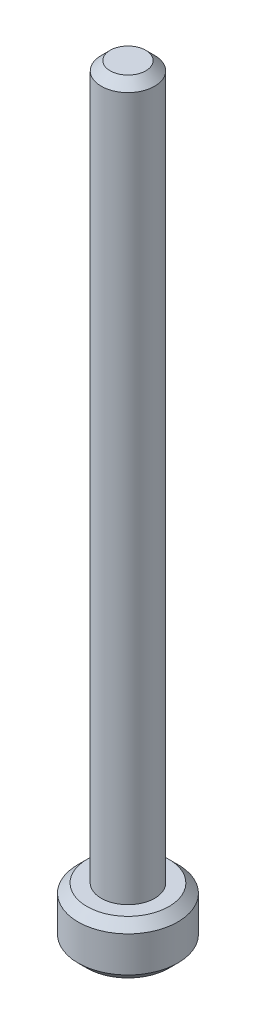
ISO-10303-21;
HEADER;
FILE_DESCRIPTION(('STEP AP214'),'2;1');
FILE_NAME('part.step','',(''),(''),'','','');
FILE_SCHEMA(('AUTOMOTIVE_DESIGN { 1 0 10303 214 1 1 1 1 }'));
ENDSEC;
DATA;
#1=APPLICATION_CONTEXT('core data for automotive mechanical design processes');
#2=APPLICATION_PROTOCOL_DEFINITION('international standard','automotive_design',2000,#1);
#3=PRODUCT_CONTEXT('',#1,'mechanical');
#4=PRODUCT('Part','Part','',(#3));
#5=PRODUCT_RELATED_PRODUCT_CATEGORY('part','',(#4));
#6=PRODUCT_DEFINITION_FORMATION('','',#4);
#7=PRODUCT_DEFINITION_CONTEXT('part definition',#1,'design');
#8=PRODUCT_DEFINITION('design','',#6,#7);
#9=PRODUCT_DEFINITION_SHAPE('','',#8);
#10=(LENGTH_UNIT() NAMED_UNIT(*) SI_UNIT(.MILLI.,.METRE.));
#11=(NAMED_UNIT(*) PLANE_ANGLE_UNIT() SI_UNIT($,.RADIAN.));
#12=(NAMED_UNIT(*) SI_UNIT($,.STERADIAN.) SOLID_ANGLE_UNIT());
#13=UNCERTAINTY_MEASURE_WITH_UNIT(LENGTH_MEASURE(1.E-05),#10,'distance_accuracy_value','');
#14=(GEOMETRIC_REPRESENTATION_CONTEXT(3) GLOBAL_UNCERTAINTY_ASSIGNED_CONTEXT((#13)) GLOBAL_UNIT_ASSIGNED_CONTEXT((#10,
#11,#12)) REPRESENTATION_CONTEXT('',''));
#15=CARTESIAN_POINT('',(0.,0.,0.));
#16=DIRECTION('',(0.,0.,1.));
#17=DIRECTION('',(1.,0.,0.));
#18=AXIS2_PLACEMENT_3D('',#15,#16,#17);
#19=CARTESIAN_POINT('',(0.,1.5,0.));
#20=DIRECTION('',(0.,-1.,0.));
#21=DIRECTION('',(0.,0.,-1.));
#22=AXIS2_PLACEMENT_3D('',#19,#20,#21);
#23=CYLINDRICAL_SURFACE('',#22,2.8);
#24=CARTESIAN_POINT('',(0.,1.,0.));
#25=DIRECTION('',(0.,1.,0.));
#26=DIRECTION('',(0.,0.,1.));
#27=AXIS2_PLACEMENT_3D('',#24,#25,#26);
#28=CIRCLE('',#27,2.8);
#29=CARTESIAN_POINT('',(0.,1.,2.8));
#30=VERTEX_POINT('',#29);
#31=EDGE_CURVE('E42',#30,#30,#28,.F.);
#32=ORIENTED_EDGE('',*,*,#31,.T.);
#33=EDGE_LOOP('',(#32));
#34=FACE_BOUND('',#33,.T.);
#35=CARTESIAN_POINT('',(0.,-0.999999999999992,0.));
#36=DIRECTION('',(0.,1.,0.));
#37=DIRECTION('',(0.,0.,1.));
#38=AXIS2_PLACEMENT_3D('',#35,#36,#37);
#39=CIRCLE('',#38,2.8);
#40=CARTESIAN_POINT('',(0.,-0.999999999999992,2.8));
#41=VERTEX_POINT('',#40);
#42=EDGE_CURVE('E46',#41,#41,#39,.T.);
#43=ORIENTED_EDGE('',*,*,#42,.T.);
#44=EDGE_LOOP('',(#43));
#45=FACE_BOUND('',#44,.T.);
#46=ADVANCED_FACE('F34',(#34,#45),#23,.T.);
#47=CARTESIAN_POINT('',(0.,1.5,0.));
#48=DIRECTION('',(0.,1.,0.));
#49=DIRECTION('',(0.,0.,1.));
#50=AXIS2_PLACEMENT_3D('',#47,#48,#49);
#51=PLANE('',#50);
#52=CARTESIAN_POINT('',(0.,1.5,0.));
#53=DIRECTION('',(0.,1.,0.));
#54=DIRECTION('',(0.,0.,1.));
#55=AXIS2_PLACEMENT_3D('',#52,#53,#54);
#56=CIRCLE('',#55,2.3);
#57=CARTESIAN_POINT('',(0.,1.5,2.3));
#58=VERTEX_POINT('',#57);
#59=EDGE_CURVE('E50',#58,#58,#56,.T.);
#60=ORIENTED_EDGE('',*,*,#59,.T.);
#61=EDGE_LOOP('',(#60));
#62=FACE_BOUND('',#61,.T.);
#63=CARTESIAN_POINT('',(0.,1.5,0.));
#64=DIRECTION('',(0.,1.,0.));
#65=DIRECTION('',(0.,0.,1.));
#66=AXIS2_PLACEMENT_3D('',#63,#64,#65);
#67=CIRCLE('',#66,1.5);
#68=CARTESIAN_POINT('',(0.,1.5,1.5));
#69=VERTEX_POINT('',#68);
#70=EDGE_CURVE('E61',#69,#69,#67,.T.);
#71=ORIENTED_EDGE('',*,*,#70,.F.);
#72=EDGE_LOOP('',(#71));
#73=FACE_BOUND('',#72,.T.);
#74=ADVANCED_FACE('F67',(#62,#73),#51,.T.);
#75=CARTESIAN_POINT('',(0.,-1.5,0.));
#76=DIRECTION('',(0.,1.,0.));
#77=DIRECTION('',(0.,0.,1.));
#78=AXIS2_PLACEMENT_3D('',#75,#76,#77);
#79=PLANE('',#78);
#80=CARTESIAN_POINT('',(0.,-1.5,0.));
#81=DIRECTION('',(0.,1.,0.));
#82=DIRECTION('',(0.,0.,1.));
#83=AXIS2_PLACEMENT_3D('',#80,#81,#82);
#84=CIRCLE('',#83,2.29999999999999);
#85=CARTESIAN_POINT('',(0.,-1.5,2.29999999999999));
#86=VERTEX_POINT('',#85);
#87=EDGE_CURVE('E10',#86,#86,#84,.F.);
#88=ORIENTED_EDGE('',*,*,#87,.T.);
#89=EDGE_LOOP('',(#88));
#90=FACE_BOUND('',#89,.T.);
#91=ADVANCED_FACE('F69',(#90),#79,.F.);
#92=CARTESIAN_POINT('',(0.,41.5,0.));
#93=DIRECTION('',(0.,-1.,0.));
#94=DIRECTION('',(0.,0.,-1.));
#95=AXIS2_PLACEMENT_3D('',#92,#93,#94);
#96=CYLINDRICAL_SURFACE('',#95,1.5);
#97=CARTESIAN_POINT('',(0.,41.,0.));
#98=DIRECTION('',(0.,1.,0.));
#99=DIRECTION('',(0.,0.,1.));
#100=AXIS2_PLACEMENT_3D('',#97,#98,#99);
#101=CIRCLE('',#100,1.5);
#102=CARTESIAN_POINT('',(0.,41.,1.5));
#103=VERTEX_POINT('',#102);
#104=EDGE_CURVE('E55',#103,#103,#101,.F.);
#105=ORIENTED_EDGE('',*,*,#104,.T.);
#106=EDGE_LOOP('',(#105));
#107=FACE_BOUND('',#106,.T.);
#108=ORIENTED_EDGE('',*,*,#70,.T.);
#109=EDGE_LOOP('',(#108));
#110=FACE_BOUND('',#109,.T.);
#111=ADVANCED_FACE('F65',(#107,#110),#96,.T.);
#112=CARTESIAN_POINT('',(0.,41.5,0.));
#113=DIRECTION('',(0.,1.,0.));
#114=DIRECTION('',(0.,0.,1.));
#115=AXIS2_PLACEMENT_3D('',#112,#113,#114);
#116=PLANE('',#115);
#117=CARTESIAN_POINT('',(0.,41.5,0.));
#118=DIRECTION('',(0.,1.,0.));
#119=DIRECTION('',(0.,0.,1.));
#120=AXIS2_PLACEMENT_3D('',#117,#118,#119);
#121=CIRCLE('',#120,1.00000000000001);
#122=CARTESIAN_POINT('',(0.,41.5,1.00000000000001));
#123=VERTEX_POINT('',#122);
#124=EDGE_CURVE('E58',#123,#123,#121,.T.);
#125=ORIENTED_EDGE('',*,*,#124,.T.);
#126=EDGE_LOOP('',(#125));
#127=FACE_BOUND('',#126,.T.);
#128=ADVANCED_FACE('F88',(#127),#116,.T.);
#129=CARTESIAN_POINT('',(0.,41.5,0.));
#130=DIRECTION('',(0.,-1.,0.));
#131=DIRECTION('',(0.,0.,-1.));
#132=AXIS2_PLACEMENT_3D('',#129,#130,#131);
#133=CONICAL_SURFACE('',#132,1.00000000000001,0.785398163397433);
#134=ORIENTED_EDGE('',*,*,#104,.F.);
#135=EDGE_LOOP('',(#134));
#136=FACE_BOUND('',#135,.T.);
#137=ORIENTED_EDGE('',*,*,#124,.F.);
#138=EDGE_LOOP('',(#137));
#139=FACE_BOUND('',#138,.T.);
#140=ADVANCED_FACE('F82',(#136,#139),#133,.T.);
#141=CARTESIAN_POINT('',(0.,1.5,0.));
#142=DIRECTION('',(0.,-1.,0.));
#143=DIRECTION('',(0.,0.,-1.));
#144=AXIS2_PLACEMENT_3D('',#141,#142,#143);
#145=CONICAL_SURFACE('',#144,2.3,0.785398163397446);
#146=ORIENTED_EDGE('',*,*,#31,.F.);
#147=EDGE_LOOP('',(#146));
#148=FACE_BOUND('',#147,.T.);
#149=ORIENTED_EDGE('',*,*,#59,.F.);
#150=EDGE_LOOP('',(#149));
#151=FACE_BOUND('',#150,.T.);
#152=ADVANCED_FACE('F87',(#148,#151),#145,.T.);
#153=CARTESIAN_POINT('',(0.,-0.999999999999992,0.));
#154=DIRECTION('',(0.,1.,0.));
#155=DIRECTION('',(0.,0.,1.));
#156=AXIS2_PLACEMENT_3D('',#153,#154,#155);
#157=CONICAL_SURFACE('',#156,2.8,0.785398163397451);
#158=ORIENTED_EDGE('',*,*,#87,.F.);
#159=EDGE_LOOP('',(#158));
#160=FACE_BOUND('',#159,.T.);
#161=ORIENTED_EDGE('',*,*,#42,.F.);
#162=EDGE_LOOP('',(#161));
#163=FACE_BOUND('',#162,.T.);
#164=ADVANCED_FACE('F37',(#160,#163),#157,.T.);
#165=CLOSED_SHELL('',(#46,#74,#91,#111,#128,#140,#152,#164));
#166=MANIFOLD_SOLID_BREP('B2',#165);
#167=ADVANCED_BREP_SHAPE_REPRESENTATION('',(#18,#166),#14);
#168=SHAPE_DEFINITION_REPRESENTATION(#9,#167);
ENDSEC;
END-ISO-10303-21;
